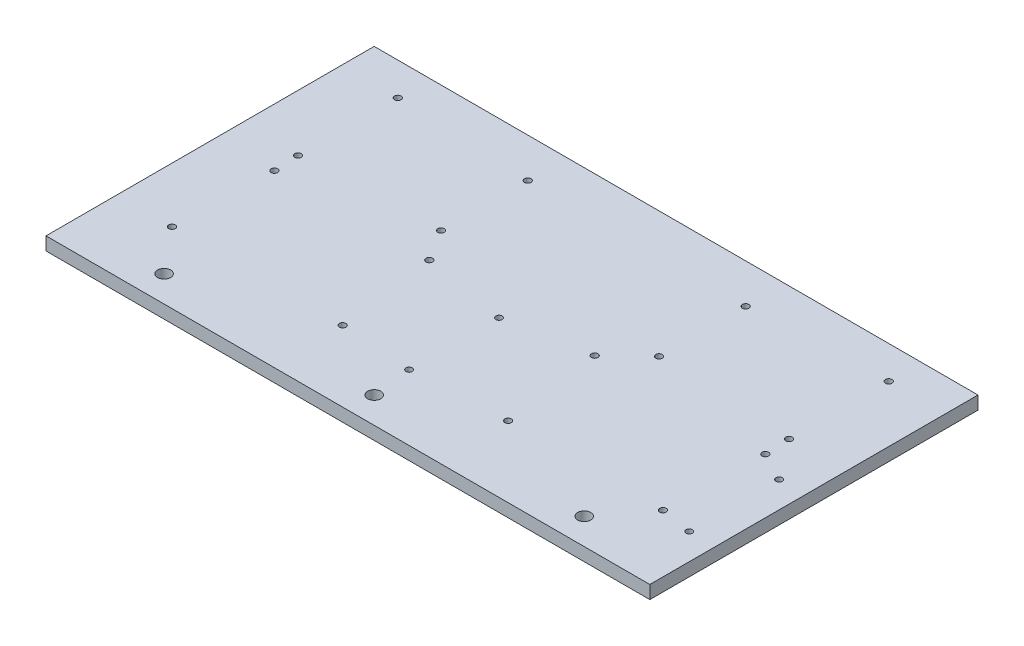
ISO-10303-21;
HEADER;
FILE_DESCRIPTION(('STEP AP214'),'2;1');
FILE_NAME('part.step','',(''),(''),'','','');
FILE_SCHEMA(('AUTOMOTIVE_DESIGN { 1 0 10303 214 1 1 1 1 }'));
ENDSEC;
DATA;
#1=APPLICATION_CONTEXT('core data for automotive mechanical design processes');
#2=APPLICATION_PROTOCOL_DEFINITION('international standard','automotive_design',2000,#1);
#3=PRODUCT_CONTEXT('',#1,'mechanical');
#4=PRODUCT('Part','Part','',(#3));
#5=PRODUCT_RELATED_PRODUCT_CATEGORY('part','',(#4));
#6=PRODUCT_DEFINITION_FORMATION('','',#4);
#7=PRODUCT_DEFINITION_CONTEXT('part definition',#1,'design');
#8=PRODUCT_DEFINITION('design','',#6,#7);
#9=PRODUCT_DEFINITION_SHAPE('','',#8);
#10=(LENGTH_UNIT() NAMED_UNIT(*) SI_UNIT(.MILLI.,.METRE.));
#11=(NAMED_UNIT(*) PLANE_ANGLE_UNIT() SI_UNIT($,.RADIAN.));
#12=(NAMED_UNIT(*) SI_UNIT($,.STERADIAN.) SOLID_ANGLE_UNIT());
#13=UNCERTAINTY_MEASURE_WITH_UNIT(LENGTH_MEASURE(1.E-05),#10,'distance_accuracy_value','');
#14=(GEOMETRIC_REPRESENTATION_CONTEXT(3) GLOBAL_UNCERTAINTY_ASSIGNED_CONTEXT((#13)) GLOBAL_UNIT_ASSIGNED_CONTEXT((#10,
#11,#12)) REPRESENTATION_CONTEXT('',''));
#15=CARTESIAN_POINT('',(0.,0.,0.));
#16=DIRECTION('',(0.,0.,1.));
#17=DIRECTION('',(1.,0.,0.));
#18=AXIS2_PLACEMENT_3D('',#15,#16,#17);
#19=CARTESIAN_POINT('',(0.,6.35,0.));
#20=DIRECTION('',(1.,0.,0.));
#21=DIRECTION('',(0.,0.,-1.));
#22=AXIS2_PLACEMENT_3D('',#19,#20,#21);
#23=PLANE('',#22);
#24=DIRECTION('',(0.,0.,1.));
#25=VECTOR('',#24,1.);
#26=CARTESIAN_POINT('',(0.,0.,0.));
#27=LINE('',#26,#25);
#28=CARTESIAN_POINT('',(0.,0.,-158.75));
#29=VERTEX_POINT('',#28);
#30=CARTESIAN_POINT('',(0.,0.,0.));
#31=VERTEX_POINT('',#30);
#32=EDGE_CURVE('E96',#29,#31,#27,.T.);
#33=ORIENTED_EDGE('',*,*,#32,.T.);
#34=DIRECTION('',(0.,-1.,0.));
#35=VECTOR('',#34,1.);
#36=CARTESIAN_POINT('',(0.,6.35,0.));
#37=LINE('',#36,#35);
#38=CARTESIAN_POINT('',(0.,6.35,0.));
#39=VERTEX_POINT('',#38);
#40=EDGE_CURVE('E11',#39,#31,#37,.T.);
#41=ORIENTED_EDGE('',*,*,#40,.F.);
#42=DIRECTION('',(0.,0.,1.));
#43=VECTOR('',#42,1.);
#44=CARTESIAN_POINT('',(0.,6.35,0.));
#45=LINE('',#44,#43);
#46=CARTESIAN_POINT('',(0.,6.35,-158.75));
#47=VERTEX_POINT('',#46);
#48=EDGE_CURVE('E84',#47,#39,#45,.T.);
#49=ORIENTED_EDGE('',*,*,#48,.F.);
#50=DIRECTION('',(0.,-1.,0.));
#51=VECTOR('',#50,1.);
#52=CARTESIAN_POINT('',(0.,6.35,-158.75));
#53=LINE('',#52,#51);
#54=EDGE_CURVE('E92',#47,#29,#53,.T.);
#55=ORIENTED_EDGE('',*,*,#54,.T.);
#56=EDGE_LOOP('',(#33,#41,#49,#55));
#57=FACE_BOUND('',#56,.T.);
#58=ADVANCED_FACE('F33',(#57),#23,.F.);
#59=CARTESIAN_POINT('',(0.,6.35,0.));
#60=DIRECTION('',(0.,0.,-1.));
#61=DIRECTION('',(-1.,0.,0.));
#62=AXIS2_PLACEMENT_3D('',#59,#60,#61);
#63=PLANE('',#62);
#64=DIRECTION('',(1.,0.,0.));
#65=VECTOR('',#64,1.);
#66=CARTESIAN_POINT('',(0.,0.,0.));
#67=LINE('',#66,#65);
#68=CARTESIAN_POINT('',(292.1,0.,0.));
#69=VERTEX_POINT('',#68);
#70=EDGE_CURVE('E88',#31,#69,#67,.T.);
#71=ORIENTED_EDGE('',*,*,#70,.T.);
#72=DIRECTION('',(0.,-1.,0.));
#73=VECTOR('',#72,1.);
#74=CARTESIAN_POINT('',(292.1,6.35,0.));
#75=LINE('',#74,#73);
#76=CARTESIAN_POINT('',(292.1,6.35,0.));
#77=VERTEX_POINT('',#76);
#78=EDGE_CURVE('E41',#77,#69,#75,.T.);
#79=ORIENTED_EDGE('',*,*,#78,.F.);
#80=DIRECTION('',(1.,0.,0.));
#81=VECTOR('',#80,1.);
#82=CARTESIAN_POINT('',(0.,6.35,0.));
#83=LINE('',#82,#81);
#84=EDGE_CURVE('E79',#39,#77,#83,.T.);
#85=ORIENTED_EDGE('',*,*,#84,.F.);
#86=ORIENTED_EDGE('',*,*,#40,.T.);
#87=EDGE_LOOP('',(#71,#79,#85,#86));
#88=FACE_BOUND('',#87,.T.);
#89=ADVANCED_FACE('F87',(#88),#63,.F.);
#90=CARTESIAN_POINT('',(292.1,6.35,0.));
#91=DIRECTION('',(-1.,0.,0.));
#92=DIRECTION('',(0.,0.,1.));
#93=AXIS2_PLACEMENT_3D('',#90,#91,#92);
#94=PLANE('',#93);
#95=DIRECTION('',(0.,0.,-1.));
#96=VECTOR('',#95,1.);
#97=CARTESIAN_POINT('',(292.1,0.,0.));
#98=LINE('',#97,#96);
#99=CARTESIAN_POINT('',(292.1,0.,-158.75));
#100=VERTEX_POINT('',#99);
#101=EDGE_CURVE('E66',#69,#100,#98,.T.);
#102=ORIENTED_EDGE('',*,*,#101,.T.);
#103=DIRECTION('',(0.,-1.,0.));
#104=VECTOR('',#103,1.);
#105=CARTESIAN_POINT('',(292.1,6.35,-158.75));
#106=LINE('',#105,#104);
#107=CARTESIAN_POINT('',(292.1,6.35,-158.75));
#108=VERTEX_POINT('',#107);
#109=EDGE_CURVE('E89',#108,#100,#106,.T.);
#110=ORIENTED_EDGE('',*,*,#109,.F.);
#111=DIRECTION('',(0.,0.,-1.));
#112=VECTOR('',#111,1.);
#113=CARTESIAN_POINT('',(292.1,6.35,0.));
#114=LINE('',#113,#112);
#115=EDGE_CURVE('E82',#77,#108,#114,.T.);
#116=ORIENTED_EDGE('',*,*,#115,.F.);
#117=ORIENTED_EDGE('',*,*,#78,.T.);
#118=EDGE_LOOP('',(#102,#110,#116,#117));
#119=FACE_BOUND('',#118,.T.);
#120=ADVANCED_FACE('F90',(#119),#94,.F.);
#121=CARTESIAN_POINT('',(0.,6.35,-158.75));
#122=DIRECTION('',(0.,0.,1.));
#123=DIRECTION('',(1.,0.,0.));
#124=AXIS2_PLACEMENT_3D('',#121,#122,#123);
#125=PLANE('',#124);
#126=DIRECTION('',(-1.,0.,0.));
#127=VECTOR('',#126,1.);
#128=CARTESIAN_POINT('',(0.,0.,-158.75));
#129=LINE('',#128,#127);
#130=EDGE_CURVE('E72',#100,#29,#129,.T.);
#131=ORIENTED_EDGE('',*,*,#130,.T.);
#132=ORIENTED_EDGE('',*,*,#54,.F.);
#133=DIRECTION('',(-1.,0.,0.));
#134=VECTOR('',#133,1.);
#135=CARTESIAN_POINT('',(0.,6.35,-158.75));
#136=LINE('',#135,#134);
#137=EDGE_CURVE('E49',#108,#47,#136,.T.);
#138=ORIENTED_EDGE('',*,*,#137,.F.);
#139=ORIENTED_EDGE('',*,*,#109,.T.);
#140=EDGE_LOOP('',(#131,#132,#138,#139));
#141=FACE_BOUND('',#140,.T.);
#142=ADVANCED_FACE('F104',(#141),#125,.F.);
#143=CARTESIAN_POINT('',(0.,6.35,0.));
#144=DIRECTION('',(0.,-1.,0.));
#145=DIRECTION('',(0.,0.,-1.));
#146=AXIS2_PLACEMENT_3D('',#143,#144,#145);
#147=PLANE('',#146);
#148=CARTESIAN_POINT('',(279.4,6.35,-75.25));
#149=DIRECTION('',(0.,1.,0.));
#150=DIRECTION('',(0.,0.,1.));
#151=AXIS2_PLACEMENT_3D('',#148,#149,#150);
#152=CIRCLE('',#151,1.52499999999998);
#153=CARTESIAN_POINT('',(279.4,6.35,-73.725));
#154=VERTEX_POINT('',#153);
#155=EDGE_CURVE('E242',#154,#154,#152,.T.);
#156=ORIENTED_EDGE('',*,*,#155,.F.);
#157=EDGE_LOOP('',(#156));
#158=FACE_BOUND('',#157,.T.);
#159=CARTESIAN_POINT('',(143.9,6.35,-75.25));
#160=DIRECTION('',(0.,1.,0.));
#161=DIRECTION('',(0.,0.,1.));
#162=AXIS2_PLACEMENT_3D('',#159,#160,#161);
#163=CIRCLE('',#162,1.52500000000001);
#164=CARTESIAN_POINT('',(143.9,6.35,-73.725));
#165=VERTEX_POINT('',#164);
#166=EDGE_CURVE('E236',#165,#165,#163,.T.);
#167=ORIENTED_EDGE('',*,*,#166,.F.);
#168=EDGE_LOOP('',(#167));
#169=FACE_BOUND('',#168,.T.);
#170=CARTESIAN_POINT('',(143.9,6.35,-31.75));
#171=DIRECTION('',(0.,1.,0.));
#172=DIRECTION('',(0.,0.,1.));
#173=AXIS2_PLACEMENT_3D('',#170,#171,#172);
#174=CIRCLE('',#173,1.52500000000001);
#175=CARTESIAN_POINT('',(143.9,6.35,-30.225));
#176=VERTEX_POINT('',#175);
#177=EDGE_CURVE('E230',#176,#176,#174,.T.);
#178=ORIENTED_EDGE('',*,*,#177,.F.);
#179=EDGE_LOOP('',(#178));
#180=FACE_BOUND('',#179,.T.);
#181=CARTESIAN_POINT('',(279.4,6.35,-31.75));
#182=DIRECTION('',(0.,1.,0.));
#183=DIRECTION('',(0.,0.,1.));
#184=AXIS2_PLACEMENT_3D('',#181,#182,#183);
#185=CIRCLE('',#184,1.52499999999998);
#186=CARTESIAN_POINT('',(279.4,6.35,-30.225));
#187=VERTEX_POINT('',#186);
#188=EDGE_CURVE('E224',#187,#187,#185,.T.);
#189=ORIENTED_EDGE('',*,*,#188,.F.);
#190=EDGE_LOOP('',(#189));
#191=FACE_BOUND('',#190,.T.);
#192=CARTESIAN_POINT('',(189.23,6.35,-34.29));
#193=DIRECTION('',(0.,1.,0.));
#194=DIRECTION('',(0.,0.,1.));
#195=AXIS2_PLACEMENT_3D('',#192,#193,#194);
#196=CIRCLE('',#195,1.58749999999999);
#197=CARTESIAN_POINT('',(189.23,6.35,-32.7025));
#198=VERTEX_POINT('',#197);
#199=EDGE_CURVE('E219',#198,#198,#196,.T.);
#200=ORIENTED_EDGE('',*,*,#199,.F.);
#201=EDGE_LOOP('',(#200));
#202=FACE_BOUND('',#201,.T.);
#203=CARTESIAN_POINT('',(265.43,6.35,-82.55));
#204=DIRECTION('',(0.,1.,0.));
#205=DIRECTION('',(0.,0.,1.));
#206=AXIS2_PLACEMENT_3D('',#203,#204,#205);
#207=CIRCLE('',#206,1.58750000000004);
#208=CARTESIAN_POINT('',(265.43,6.35,-80.9624999999999));
#209=VERTEX_POINT('',#208);
#210=EDGE_CURVE('E213',#209,#209,#207,.T.);
#211=ORIENTED_EDGE('',*,*,#210,.F.);
#212=EDGE_LOOP('',(#211));
#213=FACE_BOUND('',#212,.T.);
#214=CARTESIAN_POINT('',(264.16,6.35,-34.29));
#215=DIRECTION('',(0.,1.,0.));
#216=DIRECTION('',(0.,0.,1.));
#217=AXIS2_PLACEMENT_3D('',#214,#215,#216);
#218=CIRCLE('',#217,1.58750000000004);
#219=CARTESIAN_POINT('',(264.16,6.35,-32.7025));
#220=VERTEX_POINT('',#219);
#221=EDGE_CURVE('E207',#220,#220,#218,.T.);
#222=ORIENTED_EDGE('',*,*,#221,.F.);
#223=EDGE_LOOP('',(#222));
#224=FACE_BOUND('',#223,.T.);
#225=CARTESIAN_POINT('',(264.795,6.35,-142.875));
#226=DIRECTION('',(0.,1.,0.));
#227=DIRECTION('',(0.,0.,1.));
#228=AXIS2_PLACEMENT_3D('',#225,#226,#227);
#229=CIRCLE('',#228,1.58749999999999);
#230=CARTESIAN_POINT('',(264.795,6.35,-141.2875));
#231=VERTEX_POINT('',#230);
#232=EDGE_CURVE('E201',#231,#231,#229,.T.);
#233=ORIENTED_EDGE('',*,*,#232,.F.);
#234=EDGE_LOOP('',(#233));
#235=FACE_BOUND('',#234,.T.);
#236=CARTESIAN_POINT('',(264.795,6.35,-94.615));
#237=DIRECTION('',(0.,1.,0.));
#238=DIRECTION('',(0.,0.,1.));
#239=AXIS2_PLACEMENT_3D('',#236,#237,#238);
#240=CIRCLE('',#239,1.58749999999998);
#241=CARTESIAN_POINT('',(264.795,6.35,-93.0275));
#242=VERTEX_POINT('',#241);
#243=EDGE_CURVE('E195',#242,#242,#240,.T.);
#244=ORIENTED_EDGE('',*,*,#243,.F.);
#245=EDGE_LOOP('',(#244));
#246=FACE_BOUND('',#245,.T.);
#247=CARTESIAN_POINT('',(198.755,6.35,-97.79));
#248=DIRECTION('',(0.,1.,0.));
#249=DIRECTION('',(0.,0.,1.));
#250=AXIS2_PLACEMENT_3D('',#247,#248,#249);
#251=CIRCLE('',#250,1.58749999999999);
#252=CARTESIAN_POINT('',(198.755,6.35,-96.2025));
#253=VERTEX_POINT('',#252);
#254=EDGE_CURVE('E189',#253,#253,#251,.T.);
#255=ORIENTED_EDGE('',*,*,#254,.F.);
#256=EDGE_LOOP('',(#255));
#257=FACE_BOUND('',#256,.T.);
#258=CARTESIAN_POINT('',(198.755,6.35,-139.7));
#259=DIRECTION('',(0.,1.,0.));
#260=DIRECTION('',(0.,0.,1.));
#261=AXIS2_PLACEMENT_3D('',#258,#259,#260);
#262=CIRCLE('',#261,1.58749999999999);
#263=CARTESIAN_POINT('',(198.755,6.35,-138.1125));
#264=VERTEX_POINT('',#263);
#265=EDGE_CURVE('E183',#264,#264,#262,.T.);
#266=ORIENTED_EDGE('',*,*,#265,.F.);
#267=EDGE_LOOP('',(#266));
#268=FACE_BOUND('',#267,.T.);
#269=CARTESIAN_POINT('',(102.87,6.35,-82.55));
#270=DIRECTION('',(0.,1.,0.));
#271=DIRECTION('',(0.,0.,1.));
#272=AXIS2_PLACEMENT_3D('',#269,#270,#271);
#273=CIRCLE('',#272,1.5875);
#274=CARTESIAN_POINT('',(102.87,6.35,-80.9625));
#275=VERTEX_POINT('',#274);
#276=EDGE_CURVE('E177',#275,#275,#273,.T.);
#277=ORIENTED_EDGE('',*,*,#276,.F.);
#278=EDGE_LOOP('',(#277));
#279=FACE_BOUND('',#278,.T.);
#280=CARTESIAN_POINT('',(109.22,6.35,-34.29));
#281=DIRECTION('',(0.,1.,0.));
#282=DIRECTION('',(0.,0.,1.));
#283=AXIS2_PLACEMENT_3D('',#280,#281,#282);
#284=CIRCLE('',#283,1.58749999999999);
#285=CARTESIAN_POINT('',(109.22,6.35,-32.7025));
#286=VERTEX_POINT('',#285);
#287=EDGE_CURVE('E171',#286,#286,#284,.T.);
#288=ORIENTED_EDGE('',*,*,#287,.F.);
#289=EDGE_LOOP('',(#288));
#290=FACE_BOUND('',#289,.T.);
#291=CARTESIAN_POINT('',(26.67,6.35,-34.29));
#292=DIRECTION('',(0.,1.,0.));
#293=DIRECTION('',(0.,0.,1.));
#294=AXIS2_PLACEMENT_3D('',#291,#292,#293);
#295=CIRCLE('',#294,1.5875);
#296=CARTESIAN_POINT('',(26.67,6.35,-32.7025));
#297=VERTEX_POINT('',#296);
#298=EDGE_CURVE('E165',#297,#297,#295,.T.);
#299=ORIENTED_EDGE('',*,*,#298,.F.);
#300=EDGE_LOOP('',(#299));
#301=FACE_BOUND('',#300,.T.);
#302=CARTESIAN_POINT('',(27.94,6.35,-82.55));
#303=DIRECTION('',(0.,1.,0.));
#304=DIRECTION('',(0.,0.,1.));
#305=AXIS2_PLACEMENT_3D('',#302,#303,#304);
#306=CIRCLE('',#305,1.58750000000001);
#307=CARTESIAN_POINT('',(27.94,6.35,-80.9625));
#308=VERTEX_POINT('',#307);
#309=EDGE_CURVE('E159',#308,#308,#306,.T.);
#310=ORIENTED_EDGE('',*,*,#309,.F.);
#311=EDGE_LOOP('',(#310));
#312=FACE_BOUND('',#311,.T.);
#313=CARTESIAN_POINT('',(93.345,6.35,-139.7));
#314=DIRECTION('',(0.,1.,0.));
#315=DIRECTION('',(0.,0.,1.));
#316=AXIS2_PLACEMENT_3D('',#313,#314,#315);
#317=CIRCLE('',#316,1.5875);
#318=CARTESIAN_POINT('',(93.345,6.35,-138.1125));
#319=VERTEX_POINT('',#318);
#320=EDGE_CURVE('E153',#319,#319,#317,.T.);
#321=ORIENTED_EDGE('',*,*,#320,.F.);
#322=EDGE_LOOP('',(#321));
#323=FACE_BOUND('',#322,.T.);
#324=CARTESIAN_POINT('',(93.345,6.35,-97.79));
#325=DIRECTION('',(0.,1.,0.));
#326=DIRECTION('',(0.,0.,1.));
#327=AXIS2_PLACEMENT_3D('',#324,#325,#326);
#328=CIRCLE('',#327,1.5875);
#329=CARTESIAN_POINT('',(93.345,6.35,-96.2025));
#330=VERTEX_POINT('',#329);
#331=EDGE_CURVE('E147',#330,#330,#328,.T.);
#332=ORIENTED_EDGE('',*,*,#331,.F.);
#333=EDGE_LOOP('',(#332));
#334=FACE_BOUND('',#333,.T.);
#335=CARTESIAN_POINT('',(27.305,6.35,-142.875));
#336=DIRECTION('',(0.,1.,0.));
#337=DIRECTION('',(0.,0.,1.));
#338=AXIS2_PLACEMENT_3D('',#335,#336,#337);
#339=CIRCLE('',#338,1.58749999999999);
#340=CARTESIAN_POINT('',(27.305,6.35,-141.2875));
#341=VERTEX_POINT('',#340);
#342=EDGE_CURVE('E141',#341,#341,#339,.T.);
#343=ORIENTED_EDGE('',*,*,#342,.F.);
#344=EDGE_LOOP('',(#343));
#345=FACE_BOUND('',#344,.T.);
#346=CARTESIAN_POINT('',(27.305,6.35,-94.615));
#347=DIRECTION('',(0.,1.,0.));
#348=DIRECTION('',(0.,0.,1.));
#349=AXIS2_PLACEMENT_3D('',#346,#347,#348);
#350=CIRCLE('',#349,1.58750000000001);
#351=CARTESIAN_POINT('',(27.305,6.35,-93.0275));
#352=VERTEX_POINT('',#351);
#353=EDGE_CURVE('E134',#352,#352,#350,.T.);
#354=ORIENTED_EDGE('',*,*,#353,.F.);
#355=EDGE_LOOP('',(#354));
#356=FACE_BOUND('',#355,.T.);
#357=CARTESIAN_POINT('',(182.88,6.35,-82.55));
#358=DIRECTION('',(0.,1.,0.));
#359=DIRECTION('',(0.,0.,1.));
#360=AXIS2_PLACEMENT_3D('',#357,#358,#359);
#361=CIRCLE('',#360,1.58749999999999);
#362=CARTESIAN_POINT('',(182.88,6.35,-80.9625));
#363=VERTEX_POINT('',#362);
#364=EDGE_CURVE('E128',#363,#363,#361,.T.);
#365=ORIENTED_EDGE('',*,*,#364,.F.);
#366=EDGE_LOOP('',(#365));
#367=FACE_BOUND('',#366,.T.);
#368=CARTESIAN_POINT('',(247.65,6.35,-12.7));
#369=DIRECTION('',(0.,1.,0.));
#370=DIRECTION('',(0.,0.,1.));
#371=AXIS2_PLACEMENT_3D('',#368,#369,#370);
#372=CIRCLE('',#371,3.175);
#373=CARTESIAN_POINT('',(247.65,6.35,-9.525));
#374=VERTEX_POINT('',#373);
#375=EDGE_CURVE('E123',#374,#374,#372,.T.);
#376=ORIENTED_EDGE('',*,*,#375,.F.);
#377=EDGE_LOOP('',(#376));
#378=FACE_BOUND('',#377,.T.);
#379=CARTESIAN_POINT('',(44.45,6.35,-12.7));
#380=DIRECTION('',(0.,1.,0.));
#381=DIRECTION('',(0.,0.,1.));
#382=AXIS2_PLACEMENT_3D('',#379,#380,#381);
#383=CIRCLE('',#382,3.175);
#384=CARTESIAN_POINT('',(44.45,6.35,-9.525));
#385=VERTEX_POINT('',#384);
#386=EDGE_CURVE('E116',#385,#385,#383,.T.);
#387=ORIENTED_EDGE('',*,*,#386,.F.);
#388=EDGE_LOOP('',(#387));
#389=FACE_BOUND('',#388,.T.);
#390=CARTESIAN_POINT('',(146.05,6.35,-12.7));
#391=DIRECTION('',(0.,1.,0.));
#392=DIRECTION('',(0.,0.,1.));
#393=AXIS2_PLACEMENT_3D('',#390,#391,#392);
#394=CIRCLE('',#393,3.175);
#395=CARTESIAN_POINT('',(146.05,6.35,-9.525));
#396=VERTEX_POINT('',#395);
#397=EDGE_CURVE('E110',#396,#396,#394,.T.);
#398=ORIENTED_EDGE('',*,*,#397,.F.);
#399=EDGE_LOOP('',(#398));
#400=FACE_BOUND('',#399,.T.);
#401=ORIENTED_EDGE('',*,*,#48,.T.);
#402=ORIENTED_EDGE('',*,*,#84,.T.);
#403=ORIENTED_EDGE('',*,*,#115,.T.);
#404=ORIENTED_EDGE('',*,*,#137,.T.);
#405=EDGE_LOOP('',(#401,#402,#403,#404));
#406=FACE_BOUND('',#405,.T.);
#407=ADVANCED_FACE('F80',(#158,#169,#180,#191,#202,#213,#224,#235,#246,#257,#268,#279,#290,#301,
#312,#323,#334,#345,#356,#367,#378,#389,#400,#406),#147,.F.);
#408=CARTESIAN_POINT('',(0.,0.,0.));
#409=DIRECTION('',(0.,-1.,0.));
#410=DIRECTION('',(0.,0.,-1.));
#411=AXIS2_PLACEMENT_3D('',#408,#409,#410);
#412=PLANE('',#411);
#413=CARTESIAN_POINT('',(279.4,0.,-75.25));
#414=DIRECTION('',(0.,1.,0.));
#415=DIRECTION('',(0.,0.,1.));
#416=AXIS2_PLACEMENT_3D('',#413,#414,#415);
#417=CIRCLE('',#416,1.52499999999998);
#418=CARTESIAN_POINT('',(279.4,0.,-73.725));
#419=VERTEX_POINT('',#418);
#420=EDGE_CURVE('E227',#419,#419,#417,.T.);
#421=ORIENTED_EDGE('',*,*,#420,.T.);
#422=EDGE_LOOP('',(#421));
#423=FACE_BOUND('',#422,.T.);
#424=CARTESIAN_POINT('',(143.9,0.,-75.25));
#425=DIRECTION('',(0.,1.,0.));
#426=DIRECTION('',(0.,0.,1.));
#427=AXIS2_PLACEMENT_3D('',#424,#425,#426);
#428=CIRCLE('',#427,1.52500000000001);
#429=CARTESIAN_POINT('',(143.9,0.,-73.725));
#430=VERTEX_POINT('',#429);
#431=EDGE_CURVE('E239',#430,#430,#428,.T.);
#432=ORIENTED_EDGE('',*,*,#431,.T.);
#433=EDGE_LOOP('',(#432));
#434=FACE_BOUND('',#433,.T.);
#435=CARTESIAN_POINT('',(143.9,0.,-31.75));
#436=DIRECTION('',(0.,1.,0.));
#437=DIRECTION('',(0.,0.,1.));
#438=AXIS2_PLACEMENT_3D('',#435,#436,#437);
#439=CIRCLE('',#438,1.52500000000001);
#440=CARTESIAN_POINT('',(143.9,0.,-30.225));
#441=VERTEX_POINT('',#440);
#442=EDGE_CURVE('E233',#441,#441,#439,.T.);
#443=ORIENTED_EDGE('',*,*,#442,.T.);
#444=EDGE_LOOP('',(#443));
#445=FACE_BOUND('',#444,.T.);
#446=CARTESIAN_POINT('',(279.4,0.,-31.75));
#447=DIRECTION('',(0.,1.,0.));
#448=DIRECTION('',(0.,0.,1.));
#449=AXIS2_PLACEMENT_3D('',#446,#447,#448);
#450=CIRCLE('',#449,1.52499999999998);
#451=CARTESIAN_POINT('',(279.4,0.,-30.225));
#452=VERTEX_POINT('',#451);
#453=EDGE_CURVE('E138',#452,#452,#450,.T.);
#454=ORIENTED_EDGE('',*,*,#453,.T.);
#455=EDGE_LOOP('',(#454));
#456=FACE_BOUND('',#455,.T.);
#457=CARTESIAN_POINT('',(189.23,0.,-34.29));
#458=DIRECTION('',(0.,1.,0.));
#459=DIRECTION('',(0.,0.,1.));
#460=AXIS2_PLACEMENT_3D('',#457,#458,#459);
#461=CIRCLE('',#460,1.58749999999999);
#462=CARTESIAN_POINT('',(189.23,0.,-32.7025));
#463=VERTEX_POINT('',#462);
#464=EDGE_CURVE('E131',#463,#463,#461,.T.);
#465=ORIENTED_EDGE('',*,*,#464,.T.);
#466=EDGE_LOOP('',(#465));
#467=FACE_BOUND('',#466,.T.);
#468=CARTESIAN_POINT('',(265.43,0.,-82.55));
#469=DIRECTION('',(0.,1.,0.));
#470=DIRECTION('',(0.,0.,1.));
#471=AXIS2_PLACEMENT_3D('',#468,#469,#470);
#472=CIRCLE('',#471,1.58750000000004);
#473=CARTESIAN_POINT('',(265.43,0.,-80.9624999999999));
#474=VERTEX_POINT('',#473);
#475=EDGE_CURVE('E216',#474,#474,#472,.T.);
#476=ORIENTED_EDGE('',*,*,#475,.T.);
#477=EDGE_LOOP('',(#476));
#478=FACE_BOUND('',#477,.T.);
#479=CARTESIAN_POINT('',(264.16,0.,-34.29));
#480=DIRECTION('',(0.,1.,0.));
#481=DIRECTION('',(0.,0.,1.));
#482=AXIS2_PLACEMENT_3D('',#479,#480,#481);
#483=CIRCLE('',#482,1.58750000000004);
#484=CARTESIAN_POINT('',(264.16,0.,-32.7025));
#485=VERTEX_POINT('',#484);
#486=EDGE_CURVE('E210',#485,#485,#483,.T.);
#487=ORIENTED_EDGE('',*,*,#486,.T.);
#488=EDGE_LOOP('',(#487));
#489=FACE_BOUND('',#488,.T.);
#490=CARTESIAN_POINT('',(264.795,0.,-142.875));
#491=DIRECTION('',(0.,1.,0.));
#492=DIRECTION('',(0.,0.,1.));
#493=AXIS2_PLACEMENT_3D('',#490,#491,#492);
#494=CIRCLE('',#493,1.58749999999999);
#495=CARTESIAN_POINT('',(264.795,0.,-141.2875));
#496=VERTEX_POINT('',#495);
#497=EDGE_CURVE('E204',#496,#496,#494,.T.);
#498=ORIENTED_EDGE('',*,*,#497,.T.);
#499=EDGE_LOOP('',(#498));
#500=FACE_BOUND('',#499,.T.);
#501=CARTESIAN_POINT('',(264.795,0.,-94.615));
#502=DIRECTION('',(0.,1.,0.));
#503=DIRECTION('',(0.,0.,1.));
#504=AXIS2_PLACEMENT_3D('',#501,#502,#503);
#505=CIRCLE('',#504,1.58749999999998);
#506=CARTESIAN_POINT('',(264.795,0.,-93.0275));
#507=VERTEX_POINT('',#506);
#508=EDGE_CURVE('E198',#507,#507,#505,.T.);
#509=ORIENTED_EDGE('',*,*,#508,.T.);
#510=EDGE_LOOP('',(#509));
#511=FACE_BOUND('',#510,.T.);
#512=CARTESIAN_POINT('',(198.755,0.,-97.79));
#513=DIRECTION('',(0.,1.,0.));
#514=DIRECTION('',(0.,0.,1.));
#515=AXIS2_PLACEMENT_3D('',#512,#513,#514);
#516=CIRCLE('',#515,1.58749999999999);
#517=CARTESIAN_POINT('',(198.755,0.,-96.2025));
#518=VERTEX_POINT('',#517);
#519=EDGE_CURVE('E192',#518,#518,#516,.T.);
#520=ORIENTED_EDGE('',*,*,#519,.T.);
#521=EDGE_LOOP('',(#520));
#522=FACE_BOUND('',#521,.T.);
#523=CARTESIAN_POINT('',(198.755,0.,-139.7));
#524=DIRECTION('',(0.,1.,0.));
#525=DIRECTION('',(0.,0.,1.));
#526=AXIS2_PLACEMENT_3D('',#523,#524,#525);
#527=CIRCLE('',#526,1.58749999999999);
#528=CARTESIAN_POINT('',(198.755,0.,-138.1125));
#529=VERTEX_POINT('',#528);
#530=EDGE_CURVE('E186',#529,#529,#527,.T.);
#531=ORIENTED_EDGE('',*,*,#530,.T.);
#532=EDGE_LOOP('',(#531));
#533=FACE_BOUND('',#532,.T.);
#534=CARTESIAN_POINT('',(102.87,0.,-82.55));
#535=DIRECTION('',(0.,1.,0.));
#536=DIRECTION('',(0.,0.,1.));
#537=AXIS2_PLACEMENT_3D('',#534,#535,#536);
#538=CIRCLE('',#537,1.5875);
#539=CARTESIAN_POINT('',(102.87,0.,-80.9625));
#540=VERTEX_POINT('',#539);
#541=EDGE_CURVE('E180',#540,#540,#538,.T.);
#542=ORIENTED_EDGE('',*,*,#541,.T.);
#543=EDGE_LOOP('',(#542));
#544=FACE_BOUND('',#543,.T.);
#545=CARTESIAN_POINT('',(109.22,0.,-34.29));
#546=DIRECTION('',(0.,1.,0.));
#547=DIRECTION('',(0.,0.,1.));
#548=AXIS2_PLACEMENT_3D('',#545,#546,#547);
#549=CIRCLE('',#548,1.58749999999999);
#550=CARTESIAN_POINT('',(109.22,0.,-32.7025));
#551=VERTEX_POINT('',#550);
#552=EDGE_CURVE('E174',#551,#551,#549,.T.);
#553=ORIENTED_EDGE('',*,*,#552,.T.);
#554=EDGE_LOOP('',(#553));
#555=FACE_BOUND('',#554,.T.);
#556=CARTESIAN_POINT('',(26.67,0.,-34.29));
#557=DIRECTION('',(0.,1.,0.));
#558=DIRECTION('',(0.,0.,1.));
#559=AXIS2_PLACEMENT_3D('',#556,#557,#558);
#560=CIRCLE('',#559,1.5875);
#561=CARTESIAN_POINT('',(26.67,0.,-32.7025));
#562=VERTEX_POINT('',#561);
#563=EDGE_CURVE('E168',#562,#562,#560,.T.);
#564=ORIENTED_EDGE('',*,*,#563,.T.);
#565=EDGE_LOOP('',(#564));
#566=FACE_BOUND('',#565,.T.);
#567=CARTESIAN_POINT('',(27.94,0.,-82.55));
#568=DIRECTION('',(0.,1.,0.));
#569=DIRECTION('',(0.,0.,1.));
#570=AXIS2_PLACEMENT_3D('',#567,#568,#569);
#571=CIRCLE('',#570,1.58750000000001);
#572=CARTESIAN_POINT('',(27.94,0.,-80.9625));
#573=VERTEX_POINT('',#572);
#574=EDGE_CURVE('E162',#573,#573,#571,.T.);
#575=ORIENTED_EDGE('',*,*,#574,.T.);
#576=EDGE_LOOP('',(#575));
#577=FACE_BOUND('',#576,.T.);
#578=CARTESIAN_POINT('',(93.345,0.,-139.7));
#579=DIRECTION('',(0.,1.,0.));
#580=DIRECTION('',(0.,0.,1.));
#581=AXIS2_PLACEMENT_3D('',#578,#579,#580);
#582=CIRCLE('',#581,1.5875);
#583=CARTESIAN_POINT('',(93.345,0.,-138.1125));
#584=VERTEX_POINT('',#583);
#585=EDGE_CURVE('E156',#584,#584,#582,.T.);
#586=ORIENTED_EDGE('',*,*,#585,.T.);
#587=EDGE_LOOP('',(#586));
#588=FACE_BOUND('',#587,.T.);
#589=CARTESIAN_POINT('',(93.345,0.,-97.79));
#590=DIRECTION('',(0.,1.,0.));
#591=DIRECTION('',(0.,0.,1.));
#592=AXIS2_PLACEMENT_3D('',#589,#590,#591);
#593=CIRCLE('',#592,1.5875);
#594=CARTESIAN_POINT('',(93.345,0.,-96.2025));
#595=VERTEX_POINT('',#594);
#596=EDGE_CURVE('E150',#595,#595,#593,.T.);
#597=ORIENTED_EDGE('',*,*,#596,.T.);
#598=EDGE_LOOP('',(#597));
#599=FACE_BOUND('',#598,.T.);
#600=CARTESIAN_POINT('',(27.305,0.,-142.875));
#601=DIRECTION('',(0.,1.,0.));
#602=DIRECTION('',(0.,0.,1.));
#603=AXIS2_PLACEMENT_3D('',#600,#601,#602);
#604=CIRCLE('',#603,1.58749999999999);
#605=CARTESIAN_POINT('',(27.305,0.,-141.2875));
#606=VERTEX_POINT('',#605);
#607=EDGE_CURVE('E144',#606,#606,#604,.T.);
#608=ORIENTED_EDGE('',*,*,#607,.T.);
#609=EDGE_LOOP('',(#608));
#610=FACE_BOUND('',#609,.T.);
#611=CARTESIAN_POINT('',(27.305,0.,-94.615));
#612=DIRECTION('',(0.,1.,0.));
#613=DIRECTION('',(0.,0.,1.));
#614=AXIS2_PLACEMENT_3D('',#611,#612,#613);
#615=CIRCLE('',#614,1.58750000000001);
#616=CARTESIAN_POINT('',(27.305,0.,-93.0275));
#617=VERTEX_POINT('',#616);
#618=EDGE_CURVE('E137',#617,#617,#615,.T.);
#619=ORIENTED_EDGE('',*,*,#618,.T.);
#620=EDGE_LOOP('',(#619));
#621=FACE_BOUND('',#620,.T.);
#622=CARTESIAN_POINT('',(182.88,0.,-82.55));
#623=DIRECTION('',(0.,1.,0.));
#624=DIRECTION('',(0.,0.,1.));
#625=AXIS2_PLACEMENT_3D('',#622,#623,#624);
#626=CIRCLE('',#625,1.58749999999999);
#627=CARTESIAN_POINT('',(182.88,0.,-80.9625));
#628=VERTEX_POINT('',#627);
#629=EDGE_CURVE('E120',#628,#628,#626,.T.);
#630=ORIENTED_EDGE('',*,*,#629,.T.);
#631=EDGE_LOOP('',(#630));
#632=FACE_BOUND('',#631,.T.);
#633=CARTESIAN_POINT('',(247.65,0.,-12.7));
#634=DIRECTION('',(0.,1.,0.));
#635=DIRECTION('',(0.,0.,1.));
#636=AXIS2_PLACEMENT_3D('',#633,#634,#635);
#637=CIRCLE('',#636,3.175);
#638=CARTESIAN_POINT('',(247.65,0.,-9.525));
#639=VERTEX_POINT('',#638);
#640=EDGE_CURVE('E113',#639,#639,#637,.T.);
#641=ORIENTED_EDGE('',*,*,#640,.T.);
#642=EDGE_LOOP('',(#641));
#643=FACE_BOUND('',#642,.T.);
#644=CARTESIAN_POINT('',(44.45,0.,-12.7));
#645=DIRECTION('',(0.,1.,0.));
#646=DIRECTION('',(0.,0.,1.));
#647=AXIS2_PLACEMENT_3D('',#644,#645,#646);
#648=CIRCLE('',#647,3.175);
#649=CARTESIAN_POINT('',(44.45,0.,-9.525));
#650=VERTEX_POINT('',#649);
#651=EDGE_CURVE('E119',#650,#650,#648,.T.);
#652=ORIENTED_EDGE('',*,*,#651,.T.);
#653=EDGE_LOOP('',(#652));
#654=FACE_BOUND('',#653,.T.);
#655=CARTESIAN_POINT('',(146.05,0.,-12.7));
#656=DIRECTION('',(0.,1.,0.));
#657=DIRECTION('',(0.,0.,1.));
#658=AXIS2_PLACEMENT_3D('',#655,#656,#657);
#659=CIRCLE('',#658,3.175);
#660=CARTESIAN_POINT('',(146.05,0.,-9.525));
#661=VERTEX_POINT('',#660);
#662=EDGE_CURVE('E99',#661,#661,#659,.T.);
#663=ORIENTED_EDGE('',*,*,#662,.T.);
#664=EDGE_LOOP('',(#663));
#665=FACE_BOUND('',#664,.T.);
#666=ORIENTED_EDGE('',*,*,#32,.F.);
#667=ORIENTED_EDGE('',*,*,#130,.F.);
#668=ORIENTED_EDGE('',*,*,#101,.F.);
#669=ORIENTED_EDGE('',*,*,#70,.F.);
#670=EDGE_LOOP('',(#666,#667,#668,#669));
#671=FACE_BOUND('',#670,.T.);
#672=ADVANCED_FACE('F107',(#423,#434,#445,#456,#467,#478,#489,#500,#511,#522,#533,#544,#555,
#566,#577,#588,#599,#610,#621,#632,#643,#654,#665,#671),#412,.T.);
#673=CARTESIAN_POINT('',(146.05,0.,-12.7));
#674=DIRECTION('',(0.,1.,0.));
#675=DIRECTION('',(0.,0.,1.));
#676=AXIS2_PLACEMENT_3D('',#673,#674,#675);
#677=CYLINDRICAL_SURFACE('',#676,3.175);
#678=ORIENTED_EDGE('',*,*,#662,.F.);
#679=EDGE_LOOP('',(#678));
#680=FACE_BOUND('',#679,.T.);
#681=ORIENTED_EDGE('',*,*,#397,.T.);
#682=EDGE_LOOP('',(#681));
#683=FACE_BOUND('',#682,.T.);
#684=ADVANCED_FACE('F304',(#680,#683),#677,.F.);
#685=CARTESIAN_POINT('',(44.45,0.,-12.7));
#686=DIRECTION('',(0.,1.,0.));
#687=DIRECTION('',(0.,0.,1.));
#688=AXIS2_PLACEMENT_3D('',#685,#686,#687);
#689=CYLINDRICAL_SURFACE('',#688,3.175);
#690=ORIENTED_EDGE('',*,*,#651,.F.);
#691=EDGE_LOOP('',(#690));
#692=FACE_BOUND('',#691,.T.);
#693=ORIENTED_EDGE('',*,*,#386,.T.);
#694=EDGE_LOOP('',(#693));
#695=FACE_BOUND('',#694,.T.);
#696=ADVANCED_FACE('F306',(#692,#695),#689,.F.);
#697=CARTESIAN_POINT('',(247.65,0.,-12.7));
#698=DIRECTION('',(0.,1.,0.));
#699=DIRECTION('',(0.,0.,1.));
#700=AXIS2_PLACEMENT_3D('',#697,#698,#699);
#701=CYLINDRICAL_SURFACE('',#700,3.175);
#702=ORIENTED_EDGE('',*,*,#640,.F.);
#703=EDGE_LOOP('',(#702));
#704=FACE_BOUND('',#703,.T.);
#705=ORIENTED_EDGE('',*,*,#375,.T.);
#706=EDGE_LOOP('',(#705));
#707=FACE_BOUND('',#706,.T.);
#708=ADVANCED_FACE('F313',(#704,#707),#701,.F.);
#709=CARTESIAN_POINT('',(182.88,0.,-82.55));
#710=DIRECTION('',(0.,1.,0.));
#711=DIRECTION('',(0.,0.,1.));
#712=AXIS2_PLACEMENT_3D('',#709,#710,#711);
#713=CYLINDRICAL_SURFACE('',#712,1.58749999999999);
#714=ORIENTED_EDGE('',*,*,#629,.F.);
#715=EDGE_LOOP('',(#714));
#716=FACE_BOUND('',#715,.T.);
#717=ORIENTED_EDGE('',*,*,#364,.T.);
#718=EDGE_LOOP('',(#717));
#719=FACE_BOUND('',#718,.T.);
#720=ADVANCED_FACE('F446',(#716,#719),#713,.F.);
#721=CARTESIAN_POINT('',(27.305,0.,-94.615));
#722=DIRECTION('',(0.,1.,0.));
#723=DIRECTION('',(0.,0.,1.));
#724=AXIS2_PLACEMENT_3D('',#721,#722,#723);
#725=CYLINDRICAL_SURFACE('',#724,1.58750000000001);
#726=ORIENTED_EDGE('',*,*,#618,.F.);
#727=EDGE_LOOP('',(#726));
#728=FACE_BOUND('',#727,.T.);
#729=ORIENTED_EDGE('',*,*,#353,.T.);
#730=EDGE_LOOP('',(#729));
#731=FACE_BOUND('',#730,.T.);
#732=ADVANCED_FACE('F442',(#728,#731),#725,.F.);
#733=CARTESIAN_POINT('',(27.305,0.,-142.875));
#734=DIRECTION('',(0.,1.,0.));
#735=DIRECTION('',(0.,0.,1.));
#736=AXIS2_PLACEMENT_3D('',#733,#734,#735);
#737=CYLINDRICAL_SURFACE('',#736,1.58749999999999);
#738=ORIENTED_EDGE('',*,*,#607,.F.);
#739=EDGE_LOOP('',(#738));
#740=FACE_BOUND('',#739,.T.);
#741=ORIENTED_EDGE('',*,*,#342,.T.);
#742=EDGE_LOOP('',(#741));
#743=FACE_BOUND('',#742,.T.);
#744=ADVANCED_FACE('F438',(#740,#743),#737,.F.);
#745=CARTESIAN_POINT('',(93.345,0.,-97.79));
#746=DIRECTION('',(0.,1.,0.));
#747=DIRECTION('',(0.,0.,1.));
#748=AXIS2_PLACEMENT_3D('',#745,#746,#747);
#749=CYLINDRICAL_SURFACE('',#748,1.5875);
#750=ORIENTED_EDGE('',*,*,#596,.F.);
#751=EDGE_LOOP('',(#750));
#752=FACE_BOUND('',#751,.T.);
#753=ORIENTED_EDGE('',*,*,#331,.T.);
#754=EDGE_LOOP('',(#753));
#755=FACE_BOUND('',#754,.T.);
#756=ADVANCED_FACE('F434',(#752,#755),#749,.F.);
#757=CARTESIAN_POINT('',(93.345,0.,-139.7));
#758=DIRECTION('',(0.,1.,0.));
#759=DIRECTION('',(0.,0.,1.));
#760=AXIS2_PLACEMENT_3D('',#757,#758,#759);
#761=CYLINDRICAL_SURFACE('',#760,1.5875);
#762=ORIENTED_EDGE('',*,*,#585,.F.);
#763=EDGE_LOOP('',(#762));
#764=FACE_BOUND('',#763,.T.);
#765=ORIENTED_EDGE('',*,*,#320,.T.);
#766=EDGE_LOOP('',(#765));
#767=FACE_BOUND('',#766,.T.);
#768=ADVANCED_FACE('F430',(#764,#767),#761,.F.);
#769=CARTESIAN_POINT('',(27.94,0.,-82.55));
#770=DIRECTION('',(0.,1.,0.));
#771=DIRECTION('',(0.,0.,1.));
#772=AXIS2_PLACEMENT_3D('',#769,#770,#771);
#773=CYLINDRICAL_SURFACE('',#772,1.58750000000001);
#774=ORIENTED_EDGE('',*,*,#574,.F.);
#775=EDGE_LOOP('',(#774));
#776=FACE_BOUND('',#775,.T.);
#777=ORIENTED_EDGE('',*,*,#309,.T.);
#778=EDGE_LOOP('',(#777));
#779=FACE_BOUND('',#778,.T.);
#780=ADVANCED_FACE('F426',(#776,#779),#773,.F.);
#781=CARTESIAN_POINT('',(26.67,0.,-34.29));
#782=DIRECTION('',(0.,1.,0.));
#783=DIRECTION('',(0.,0.,1.));
#784=AXIS2_PLACEMENT_3D('',#781,#782,#783);
#785=CYLINDRICAL_SURFACE('',#784,1.5875);
#786=ORIENTED_EDGE('',*,*,#563,.F.);
#787=EDGE_LOOP('',(#786));
#788=FACE_BOUND('',#787,.T.);
#789=ORIENTED_EDGE('',*,*,#298,.T.);
#790=EDGE_LOOP('',(#789));
#791=FACE_BOUND('',#790,.T.);
#792=ADVANCED_FACE('F422',(#788,#791),#785,.F.);
#793=CARTESIAN_POINT('',(109.22,0.,-34.29));
#794=DIRECTION('',(0.,1.,0.));
#795=DIRECTION('',(0.,0.,1.));
#796=AXIS2_PLACEMENT_3D('',#793,#794,#795);
#797=CYLINDRICAL_SURFACE('',#796,1.58749999999999);
#798=ORIENTED_EDGE('',*,*,#552,.F.);
#799=EDGE_LOOP('',(#798));
#800=FACE_BOUND('',#799,.T.);
#801=ORIENTED_EDGE('',*,*,#287,.T.);
#802=EDGE_LOOP('',(#801));
#803=FACE_BOUND('',#802,.T.);
#804=ADVANCED_FACE('F418',(#800,#803),#797,.F.);
#805=CARTESIAN_POINT('',(102.87,0.,-82.55));
#806=DIRECTION('',(0.,1.,0.));
#807=DIRECTION('',(0.,0.,1.));
#808=AXIS2_PLACEMENT_3D('',#805,#806,#807);
#809=CYLINDRICAL_SURFACE('',#808,1.5875);
#810=ORIENTED_EDGE('',*,*,#541,.F.);
#811=EDGE_LOOP('',(#810));
#812=FACE_BOUND('',#811,.T.);
#813=ORIENTED_EDGE('',*,*,#276,.T.);
#814=EDGE_LOOP('',(#813));
#815=FACE_BOUND('',#814,.T.);
#816=ADVANCED_FACE('F414',(#812,#815),#809,.F.);
#817=CARTESIAN_POINT('',(198.755,0.,-139.7));
#818=DIRECTION('',(0.,1.,0.));
#819=DIRECTION('',(0.,0.,1.));
#820=AXIS2_PLACEMENT_3D('',#817,#818,#819);
#821=CYLINDRICAL_SURFACE('',#820,1.58749999999999);
#822=ORIENTED_EDGE('',*,*,#530,.F.);
#823=EDGE_LOOP('',(#822));
#824=FACE_BOUND('',#823,.T.);
#825=ORIENTED_EDGE('',*,*,#265,.T.);
#826=EDGE_LOOP('',(#825));
#827=FACE_BOUND('',#826,.T.);
#828=ADVANCED_FACE('F410',(#824,#827),#821,.F.);
#829=CARTESIAN_POINT('',(198.755,0.,-97.79));
#830=DIRECTION('',(0.,1.,0.));
#831=DIRECTION('',(0.,0.,1.));
#832=AXIS2_PLACEMENT_3D('',#829,#830,#831);
#833=CYLINDRICAL_SURFACE('',#832,1.58749999999999);
#834=ORIENTED_EDGE('',*,*,#519,.F.);
#835=EDGE_LOOP('',(#834));
#836=FACE_BOUND('',#835,.T.);
#837=ORIENTED_EDGE('',*,*,#254,.T.);
#838=EDGE_LOOP('',(#837));
#839=FACE_BOUND('',#838,.T.);
#840=ADVANCED_FACE('F406',(#836,#839),#833,.F.);
#841=CARTESIAN_POINT('',(264.795,0.,-94.615));
#842=DIRECTION('',(0.,1.,0.));
#843=DIRECTION('',(0.,0.,1.));
#844=AXIS2_PLACEMENT_3D('',#841,#842,#843);
#845=CYLINDRICAL_SURFACE('',#844,1.58749999999998);
#846=ORIENTED_EDGE('',*,*,#508,.F.);
#847=EDGE_LOOP('',(#846));
#848=FACE_BOUND('',#847,.T.);
#849=ORIENTED_EDGE('',*,*,#243,.T.);
#850=EDGE_LOOP('',(#849));
#851=FACE_BOUND('',#850,.T.);
#852=ADVANCED_FACE('F402',(#848,#851),#845,.F.);
#853=CARTESIAN_POINT('',(264.795,0.,-142.875));
#854=DIRECTION('',(0.,1.,0.));
#855=DIRECTION('',(0.,0.,1.));
#856=AXIS2_PLACEMENT_3D('',#853,#854,#855);
#857=CYLINDRICAL_SURFACE('',#856,1.58749999999999);
#858=ORIENTED_EDGE('',*,*,#497,.F.);
#859=EDGE_LOOP('',(#858));
#860=FACE_BOUND('',#859,.T.);
#861=ORIENTED_EDGE('',*,*,#232,.T.);
#862=EDGE_LOOP('',(#861));
#863=FACE_BOUND('',#862,.T.);
#864=ADVANCED_FACE('F398',(#860,#863),#857,.F.);
#865=CARTESIAN_POINT('',(264.16,0.,-34.29));
#866=DIRECTION('',(0.,1.,0.));
#867=DIRECTION('',(0.,0.,1.));
#868=AXIS2_PLACEMENT_3D('',#865,#866,#867);
#869=CYLINDRICAL_SURFACE('',#868,1.58750000000004);
#870=ORIENTED_EDGE('',*,*,#486,.F.);
#871=EDGE_LOOP('',(#870));
#872=FACE_BOUND('',#871,.T.);
#873=ORIENTED_EDGE('',*,*,#221,.T.);
#874=EDGE_LOOP('',(#873));
#875=FACE_BOUND('',#874,.T.);
#876=ADVANCED_FACE('F394',(#872,#875),#869,.F.);
#877=CARTESIAN_POINT('',(265.43,0.,-82.55));
#878=DIRECTION('',(0.,1.,0.));
#879=DIRECTION('',(0.,0.,1.));
#880=AXIS2_PLACEMENT_3D('',#877,#878,#879);
#881=CYLINDRICAL_SURFACE('',#880,1.58750000000004);
#882=ORIENTED_EDGE('',*,*,#475,.F.);
#883=EDGE_LOOP('',(#882));
#884=FACE_BOUND('',#883,.T.);
#885=ORIENTED_EDGE('',*,*,#210,.T.);
#886=EDGE_LOOP('',(#885));
#887=FACE_BOUND('',#886,.T.);
#888=ADVANCED_FACE('F390',(#884,#887),#881,.F.);
#889=CARTESIAN_POINT('',(189.23,0.,-34.29));
#890=DIRECTION('',(0.,1.,0.));
#891=DIRECTION('',(0.,0.,1.));
#892=AXIS2_PLACEMENT_3D('',#889,#890,#891);
#893=CYLINDRICAL_SURFACE('',#892,1.58749999999999);
#894=ORIENTED_EDGE('',*,*,#464,.F.);
#895=EDGE_LOOP('',(#894));
#896=FACE_BOUND('',#895,.T.);
#897=ORIENTED_EDGE('',*,*,#199,.T.);
#898=EDGE_LOOP('',(#897));
#899=FACE_BOUND('',#898,.T.);
#900=ADVANCED_FACE('F355',(#896,#899),#893,.F.);
#901=CARTESIAN_POINT('',(279.4,0.,-31.75));
#902=DIRECTION('',(0.,1.,0.));
#903=DIRECTION('',(0.,0.,1.));
#904=AXIS2_PLACEMENT_3D('',#901,#902,#903);
#905=CYLINDRICAL_SURFACE('',#904,1.52499999999998);
#906=ORIENTED_EDGE('',*,*,#453,.F.);
#907=EDGE_LOOP('',(#906));
#908=FACE_BOUND('',#907,.T.);
#909=ORIENTED_EDGE('',*,*,#188,.T.);
#910=EDGE_LOOP('',(#909));
#911=FACE_BOUND('',#910,.T.);
#912=ADVANCED_FACE('F349',(#908,#911),#905,.F.);
#913=CARTESIAN_POINT('',(143.9,0.,-31.75));
#914=DIRECTION('',(0.,1.,0.));
#915=DIRECTION('',(0.,0.,1.));
#916=AXIS2_PLACEMENT_3D('',#913,#914,#915);
#917=CYLINDRICAL_SURFACE('',#916,1.52500000000001);
#918=ORIENTED_EDGE('',*,*,#442,.F.);
#919=EDGE_LOOP('',(#918));
#920=FACE_BOUND('',#919,.T.);
#921=ORIENTED_EDGE('',*,*,#177,.T.);
#922=EDGE_LOOP('',(#921));
#923=FACE_BOUND('',#922,.T.);
#924=ADVANCED_FACE('F354',(#920,#923),#917,.F.);
#925=CARTESIAN_POINT('',(143.9,0.,-75.25));
#926=DIRECTION('',(0.,1.,0.));
#927=DIRECTION('',(0.,0.,1.));
#928=AXIS2_PLACEMENT_3D('',#925,#926,#927);
#929=CYLINDRICAL_SURFACE('',#928,1.52500000000001);
#930=ORIENTED_EDGE('',*,*,#431,.F.);
#931=EDGE_LOOP('',(#930));
#932=FACE_BOUND('',#931,.T.);
#933=ORIENTED_EDGE('',*,*,#166,.T.);
#934=EDGE_LOOP('',(#933));
#935=FACE_BOUND('',#934,.T.);
#936=ADVANCED_FACE('F253',(#932,#935),#929,.F.);
#937=CARTESIAN_POINT('',(279.4,0.,-75.25));
#938=DIRECTION('',(0.,1.,0.));
#939=DIRECTION('',(0.,0.,1.));
#940=AXIS2_PLACEMENT_3D('',#937,#938,#939);
#941=CYLINDRICAL_SURFACE('',#940,1.52499999999998);
#942=ORIENTED_EDGE('',*,*,#420,.F.);
#943=EDGE_LOOP('',(#942));
#944=FACE_BOUND('',#943,.T.);
#945=ORIENTED_EDGE('',*,*,#155,.T.);
#946=EDGE_LOOP('',(#945));
#947=FACE_BOUND('',#946,.T.);
#948=ADVANCED_FACE('F250',(#944,#947),#941,.F.);
#949=CLOSED_SHELL('',(#58,#89,#120,#142,#407,#672,#684,#696,#708,#720,#732,#744,#756,#768,#780,
#792,#804,#816,#828,#840,#852,#864,#876,#888,#900,#912,#924,#936,#948));
#950=MANIFOLD_SOLID_BREP('B2',#949);
#951=ADVANCED_BREP_SHAPE_REPRESENTATION('',(#18,#950),#14);
#952=SHAPE_DEFINITION_REPRESENTATION(#9,#951);
ENDSEC;
END-ISO-10303-21;
